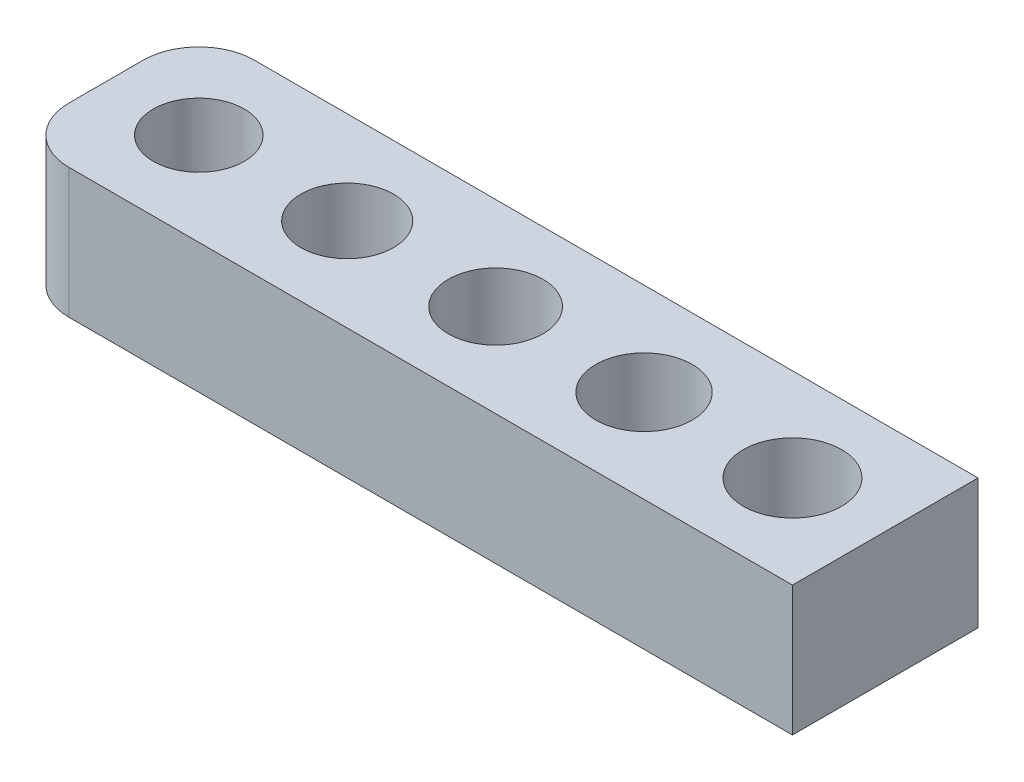
ISO-10303-21;
HEADER;
FILE_DESCRIPTION(('STEP AP214'),'2;1');
FILE_NAME('part.step','',(''),(''),'','','');
FILE_SCHEMA(('AUTOMOTIVE_DESIGN { 1 0 10303 214 1 1 1 1 }'));
ENDSEC;
DATA;
#1=APPLICATION_CONTEXT('core data for automotive mechanical design processes');
#2=APPLICATION_PROTOCOL_DEFINITION('international standard','automotive_design',2000,#1);
#3=PRODUCT_CONTEXT('',#1,'mechanical');
#4=PRODUCT('Part','Part','',(#3));
#5=PRODUCT_RELATED_PRODUCT_CATEGORY('part','',(#4));
#6=PRODUCT_DEFINITION_FORMATION('','',#4);
#7=PRODUCT_DEFINITION_CONTEXT('part definition',#1,'design');
#8=PRODUCT_DEFINITION('design','',#6,#7);
#9=PRODUCT_DEFINITION_SHAPE('','',#8);
#10=(LENGTH_UNIT() NAMED_UNIT(*) SI_UNIT(.MILLI.,.METRE.));
#11=(NAMED_UNIT(*) PLANE_ANGLE_UNIT() SI_UNIT($,.RADIAN.));
#12=(NAMED_UNIT(*) SI_UNIT($,.STERADIAN.) SOLID_ANGLE_UNIT());
#13=UNCERTAINTY_MEASURE_WITH_UNIT(LENGTH_MEASURE(1.E-05),#10,'distance_accuracy_value','');
#14=(GEOMETRIC_REPRESENTATION_CONTEXT(3) GLOBAL_UNCERTAINTY_ASSIGNED_CONTEXT((#13)) GLOBAL_UNIT_ASSIGNED_CONTEXT((#10,
#11,#12)) REPRESENTATION_CONTEXT('',''));
#15=CARTESIAN_POINT('',(0.,0.,0.));
#16=DIRECTION('',(0.,0.,1.));
#17=DIRECTION('',(1.,0.,0.));
#18=AXIS2_PLACEMENT_3D('',#15,#16,#17);
#19=CARTESIAN_POINT('',(0.,7.,0.));
#20=DIRECTION('',(0.,1.,0.));
#21=DIRECTION('',(0.,0.,1.));
#22=AXIS2_PLACEMENT_3D('',#19,#20,#21);
#23=PLANE('',#22);
#24=CARTESIAN_POINT('',(24.,7.,0.));
#25=DIRECTION('',(0.,1.,0.));
#26=DIRECTION('',(0.,0.,1.));
#27=AXIS2_PLACEMENT_3D('',#24,#25,#26);
#28=CIRCLE('',#27,2.6);
#29=CARTESIAN_POINT('',(24.,7.,2.6));
#30=VERTEX_POINT('',#29);
#31=EDGE_CURVE('E195',#30,#30,#28,.T.);
#32=ORIENTED_EDGE('',*,*,#31,.F.);
#33=EDGE_LOOP('',(#32));
#34=FACE_BOUND('',#33,.T.);
#35=CARTESIAN_POINT('',(8.,7.,0.));
#36=DIRECTION('',(0.,1.,0.));
#37=DIRECTION('',(0.,0.,1.));
#38=AXIS2_PLACEMENT_3D('',#35,#36,#37);
#39=CIRCLE('',#38,2.5);
#40=CARTESIAN_POINT('',(8.,7.,2.5));
#41=VERTEX_POINT('',#40);
#42=EDGE_CURVE('E179',#41,#41,#39,.T.);
#43=ORIENTED_EDGE('',*,*,#42,.F.);
#44=EDGE_LOOP('',(#43));
#45=FACE_BOUND('',#44,.T.);
#46=DIRECTION('',(0.,0.,1.));
#47=VECTOR('',#46,1.);
#48=CARTESIAN_POINT('',(-5.,7.,-5.));
#49=LINE('',#48,#47);
#50=CARTESIAN_POINT('',(-5.,7.,-2.));
#51=VERTEX_POINT('',#50);
#52=CARTESIAN_POINT('',(-5.,7.,2.));
#53=VERTEX_POINT('',#52);
#54=EDGE_CURVE('E105',#51,#53,#49,.T.);
#55=ORIENTED_EDGE('',*,*,#54,.T.);
#56=CARTESIAN_POINT('',(-2.,7.,2.));
#57=DIRECTION('',(0.,1.,0.));
#58=DIRECTION('',(0.,0.,1.));
#59=AXIS2_PLACEMENT_3D('',#56,#57,#58);
#60=CIRCLE('',#59,3.);
#61=CARTESIAN_POINT('',(-2.,7.,5.));
#62=VERTEX_POINT('',#61);
#63=EDGE_CURVE('E52',#53,#62,#60,.T.);
#64=ORIENTED_EDGE('',*,*,#63,.T.);
#65=DIRECTION('',(1.,0.,0.));
#66=VECTOR('',#65,1.);
#67=CARTESIAN_POINT('',(-5.,7.,5.));
#68=LINE('',#67,#66);
#69=CARTESIAN_POINT('',(37.,7.,5.));
#70=VERTEX_POINT('',#69);
#71=EDGE_CURVE('E111',#62,#70,#68,.T.);
#72=ORIENTED_EDGE('',*,*,#71,.T.);
#73=DIRECTION('',(0.,0.,-1.));
#74=VECTOR('',#73,1.);
#75=CARTESIAN_POINT('',(37.,7.,-5.));
#76=LINE('',#75,#74);
#77=CARTESIAN_POINT('',(37.,7.,-5.));
#78=VERTEX_POINT('',#77);
#79=EDGE_CURVE('E106',#70,#78,#76,.T.);
#80=ORIENTED_EDGE('',*,*,#79,.T.);
#81=DIRECTION('',(-1.,0.,0.));
#82=VECTOR('',#81,1.);
#83=CARTESIAN_POINT('',(-5.,7.,-5.));
#84=LINE('',#83,#82);
#85=CARTESIAN_POINT('',(-2.,7.,-5.));
#86=VERTEX_POINT('',#85);
#87=EDGE_CURVE('E96',#78,#86,#84,.T.);
#88=ORIENTED_EDGE('',*,*,#87,.T.);
#89=CARTESIAN_POINT('',(-2.,7.,-2.));
#90=DIRECTION('',(0.,1.,0.));
#91=DIRECTION('',(0.,0.,1.));
#92=AXIS2_PLACEMENT_3D('',#89,#90,#91);
#93=CIRCLE('',#92,3.);
#94=EDGE_CURVE('E144',#86,#51,#93,.T.);
#95=ORIENTED_EDGE('',*,*,#94,.T.);
#96=EDGE_LOOP('',(#55,#64,#72,#80,#88,#95));
#97=FACE_BOUND('',#96,.T.);
#98=CARTESIAN_POINT('',(0.,7.,0.));
#99=DIRECTION('',(0.,1.,0.));
#100=DIRECTION('',(0.,0.,1.));
#101=AXIS2_PLACEMENT_3D('',#98,#99,#100);
#102=CIRCLE('',#101,2.45);
#103=CARTESIAN_POINT('',(0.,7.,2.45));
#104=VERTEX_POINT('',#103);
#105=EDGE_CURVE('E171',#104,#104,#102,.T.);
#106=ORIENTED_EDGE('',*,*,#105,.F.);
#107=EDGE_LOOP('',(#106));
#108=FACE_BOUND('',#107,.T.);
#109=CARTESIAN_POINT('',(16.,7.,0.));
#110=DIRECTION('',(0.,1.,0.));
#111=DIRECTION('',(0.,0.,1.));
#112=AXIS2_PLACEMENT_3D('',#109,#110,#111);
#113=CIRCLE('',#112,2.55);
#114=CARTESIAN_POINT('',(16.,7.,2.55));
#115=VERTEX_POINT('',#114);
#116=EDGE_CURVE('E187',#115,#115,#113,.T.);
#117=ORIENTED_EDGE('',*,*,#116,.F.);
#118=EDGE_LOOP('',(#117));
#119=FACE_BOUND('',#118,.T.);
#120=CARTESIAN_POINT('',(32.,7.,0.));
#121=DIRECTION('',(0.,1.,0.));
#122=DIRECTION('',(0.,0.,1.));
#123=AXIS2_PLACEMENT_3D('',#120,#121,#122);
#124=CIRCLE('',#123,2.65);
#125=CARTESIAN_POINT('',(32.,7.,2.65));
#126=VERTEX_POINT('',#125);
#127=EDGE_CURVE('E203',#126,#126,#124,.T.);
#128=ORIENTED_EDGE('',*,*,#127,.F.);
#129=EDGE_LOOP('',(#128));
#130=FACE_BOUND('',#129,.T.);
#131=ADVANCED_FACE('F43',(#34,#45,#97,#108,#119,#130),#23,.T.);
#132=CARTESIAN_POINT('',(0.,0.,0.));
#133=DIRECTION('',(0.,1.,0.));
#134=DIRECTION('',(0.,0.,1.));
#135=AXIS2_PLACEMENT_3D('',#132,#133,#134);
#136=PLANE('',#135);
#137=DIRECTION('',(1.,0.,0.));
#138=VECTOR('',#137,1.);
#139=CARTESIAN_POINT('',(-5.,0.,5.));
#140=LINE('',#139,#138);
#141=CARTESIAN_POINT('',(-2.,0.,5.));
#142=VERTEX_POINT('',#141);
#143=CARTESIAN_POINT('',(37.,0.,5.));
#144=VERTEX_POINT('',#143);
#145=EDGE_CURVE('E116',#142,#144,#140,.T.);
#146=ORIENTED_EDGE('',*,*,#145,.F.);
#147=CARTESIAN_POINT('',(-2.,0.,2.));
#148=DIRECTION('',(0.,1.,0.));
#149=DIRECTION('',(0.,0.,1.));
#150=AXIS2_PLACEMENT_3D('',#147,#148,#149);
#151=CIRCLE('',#150,3.);
#152=CARTESIAN_POINT('',(-5.,0.,2.));
#153=VERTEX_POINT('',#152);
#154=EDGE_CURVE('E135',#142,#153,#151,.F.);
#155=ORIENTED_EDGE('',*,*,#154,.T.);
#156=DIRECTION('',(0.,0.,1.));
#157=VECTOR('',#156,1.);
#158=CARTESIAN_POINT('',(-5.,0.,-5.));
#159=LINE('',#158,#157);
#160=CARTESIAN_POINT('',(-5.,0.,-2.));
#161=VERTEX_POINT('',#160);
#162=EDGE_CURVE('E160',#161,#153,#159,.T.);
#163=ORIENTED_EDGE('',*,*,#162,.F.);
#164=CARTESIAN_POINT('',(-2.,0.,-2.));
#165=DIRECTION('',(0.,1.,0.));
#166=DIRECTION('',(0.,0.,1.));
#167=AXIS2_PLACEMENT_3D('',#164,#165,#166);
#168=CIRCLE('',#167,3.);
#169=CARTESIAN_POINT('',(-2.,0.,-5.));
#170=VERTEX_POINT('',#169);
#171=EDGE_CURVE('E128',#161,#170,#168,.F.);
#172=ORIENTED_EDGE('',*,*,#171,.T.);
#173=DIRECTION('',(-1.,0.,0.));
#174=VECTOR('',#173,1.);
#175=CARTESIAN_POINT('',(-5.,0.,-5.));
#176=LINE('',#175,#174);
#177=CARTESIAN_POINT('',(37.,0.,-5.));
#178=VERTEX_POINT('',#177);
#179=EDGE_CURVE('E164',#178,#170,#176,.T.);
#180=ORIENTED_EDGE('',*,*,#179,.F.);
#181=DIRECTION('',(0.,0.,-1.));
#182=VECTOR('',#181,1.);
#183=CARTESIAN_POINT('',(37.,0.,-5.));
#184=LINE('',#183,#182);
#185=EDGE_CURVE('E120',#144,#178,#184,.T.);
#186=ORIENTED_EDGE('',*,*,#185,.F.);
#187=EDGE_LOOP('',(#146,#155,#163,#172,#180,#186));
#188=FACE_BOUND('',#187,.T.);
#189=CARTESIAN_POINT('',(0.,0.,0.));
#190=DIRECTION('',(0.,1.,0.));
#191=DIRECTION('',(0.,0.,1.));
#192=AXIS2_PLACEMENT_3D('',#189,#190,#191);
#193=CIRCLE('',#192,2.45);
#194=CARTESIAN_POINT('',(0.,0.,2.45));
#195=VERTEX_POINT('',#194);
#196=EDGE_CURVE('E175',#195,#195,#193,.T.);
#197=ORIENTED_EDGE('',*,*,#196,.T.);
#198=EDGE_LOOP('',(#197));
#199=FACE_BOUND('',#198,.T.);
#200=CARTESIAN_POINT('',(8.,0.,0.));
#201=DIRECTION('',(0.,1.,0.));
#202=DIRECTION('',(0.,0.,1.));
#203=AXIS2_PLACEMENT_3D('',#200,#201,#202);
#204=CIRCLE('',#203,2.5);
#205=CARTESIAN_POINT('',(8.,0.,2.5));
#206=VERTEX_POINT('',#205);
#207=EDGE_CURVE('E183',#206,#206,#204,.T.);
#208=ORIENTED_EDGE('',*,*,#207,.T.);
#209=EDGE_LOOP('',(#208));
#210=FACE_BOUND('',#209,.T.);
#211=CARTESIAN_POINT('',(16.,0.,0.));
#212=DIRECTION('',(0.,1.,0.));
#213=DIRECTION('',(0.,0.,1.));
#214=AXIS2_PLACEMENT_3D('',#211,#212,#213);
#215=CIRCLE('',#214,2.55);
#216=CARTESIAN_POINT('',(16.,0.,2.55));
#217=VERTEX_POINT('',#216);
#218=EDGE_CURVE('E191',#217,#217,#215,.T.);
#219=ORIENTED_EDGE('',*,*,#218,.T.);
#220=EDGE_LOOP('',(#219));
#221=FACE_BOUND('',#220,.T.);
#222=CARTESIAN_POINT('',(24.,0.,0.));
#223=DIRECTION('',(0.,1.,0.));
#224=DIRECTION('',(0.,0.,1.));
#225=AXIS2_PLACEMENT_3D('',#222,#223,#224);
#226=CIRCLE('',#225,2.6);
#227=CARTESIAN_POINT('',(24.,0.,2.6));
#228=VERTEX_POINT('',#227);
#229=EDGE_CURVE('E199',#228,#228,#226,.T.);
#230=ORIENTED_EDGE('',*,*,#229,.T.);
#231=EDGE_LOOP('',(#230));
#232=FACE_BOUND('',#231,.T.);
#233=CARTESIAN_POINT('',(32.,0.,0.));
#234=DIRECTION('',(0.,1.,0.));
#235=DIRECTION('',(0.,0.,1.));
#236=AXIS2_PLACEMENT_3D('',#233,#234,#235);
#237=CIRCLE('',#236,2.65);
#238=CARTESIAN_POINT('',(32.,0.,2.65));
#239=VERTEX_POINT('',#238);
#240=EDGE_CURVE('E207',#239,#239,#237,.T.);
#241=ORIENTED_EDGE('',*,*,#240,.T.);
#242=EDGE_LOOP('',(#241));
#243=FACE_BOUND('',#242,.T.);
#244=ADVANCED_FACE('F158',(#188,#199,#210,#221,#232,#243),#136,.F.);
#245=CARTESIAN_POINT('',(37.,7.,-5.));
#246=DIRECTION('',(-1.,0.,0.));
#247=DIRECTION('',(0.,0.,1.));
#248=AXIS2_PLACEMENT_3D('',#245,#246,#247);
#249=PLANE('',#248);
#250=ORIENTED_EDGE('',*,*,#185,.T.);
#251=DIRECTION('',(0.,-1.,0.));
#252=VECTOR('',#251,1.);
#253=CARTESIAN_POINT('',(37.,7.,-5.));
#254=LINE('',#253,#252);
#255=EDGE_CURVE('E100',#78,#178,#254,.T.);
#256=ORIENTED_EDGE('',*,*,#255,.F.);
#257=ORIENTED_EDGE('',*,*,#79,.F.);
#258=DIRECTION('',(0.,-1.,0.));
#259=VECTOR('',#258,1.);
#260=CARTESIAN_POINT('',(37.,7.,5.));
#261=LINE('',#260,#259);
#262=EDGE_CURVE('E123',#70,#144,#261,.T.);
#263=ORIENTED_EDGE('',*,*,#262,.T.);
#264=EDGE_LOOP('',(#250,#256,#257,#263));
#265=FACE_BOUND('',#264,.T.);
#266=ADVANCED_FACE('F118',(#265),#249,.F.);
#267=CARTESIAN_POINT('',(-5.,7.,-5.));
#268=DIRECTION('',(0.,0.,1.));
#269=DIRECTION('',(1.,0.,0.));
#270=AXIS2_PLACEMENT_3D('',#267,#268,#269);
#271=PLANE('',#270);
#272=ORIENTED_EDGE('',*,*,#179,.T.);
#273=DIRECTION('',(0.,-1.,0.));
#274=VECTOR('',#273,1.);
#275=CARTESIAN_POINT('',(-2.,7.,-5.));
#276=LINE('',#275,#274);
#277=EDGE_CURVE('E11',#170,#86,#276,.F.);
#278=ORIENTED_EDGE('',*,*,#277,.T.);
#279=ORIENTED_EDGE('',*,*,#87,.F.);
#280=ORIENTED_EDGE('',*,*,#255,.T.);
#281=EDGE_LOOP('',(#272,#278,#279,#280));
#282=FACE_BOUND('',#281,.T.);
#283=ADVANCED_FACE('F98',(#282),#271,.F.);
#284=CARTESIAN_POINT('',(-5.,7.,-5.));
#285=DIRECTION('',(1.,0.,0.));
#286=DIRECTION('',(0.,0.,-1.));
#287=AXIS2_PLACEMENT_3D('',#284,#285,#286);
#288=PLANE('',#287);
#289=ORIENTED_EDGE('',*,*,#162,.T.);
#290=DIRECTION('',(0.,-1.,0.));
#291=VECTOR('',#290,1.);
#292=CARTESIAN_POINT('',(-5.,7.,2.));
#293=LINE('',#292,#291);
#294=EDGE_CURVE('E65',#153,#53,#293,.F.);
#295=ORIENTED_EDGE('',*,*,#294,.T.);
#296=ORIENTED_EDGE('',*,*,#54,.F.);
#297=DIRECTION('',(0.,-1.,0.));
#298=VECTOR('',#297,1.);
#299=CARTESIAN_POINT('',(-5.,7.,-2.));
#300=LINE('',#299,#298);
#301=EDGE_CURVE('E138',#51,#161,#300,.T.);
#302=ORIENTED_EDGE('',*,*,#301,.T.);
#303=EDGE_LOOP('',(#289,#295,#296,#302));
#304=FACE_BOUND('',#303,.T.);
#305=ADVANCED_FACE('F161',(#304),#288,.F.);
#306=CARTESIAN_POINT('',(-5.,7.,5.));
#307=DIRECTION('',(0.,0.,-1.));
#308=DIRECTION('',(-1.,0.,0.));
#309=AXIS2_PLACEMENT_3D('',#306,#307,#308);
#310=PLANE('',#309);
#311=ORIENTED_EDGE('',*,*,#71,.F.);
#312=DIRECTION('',(0.,-1.,0.));
#313=VECTOR('',#312,1.);
#314=CARTESIAN_POINT('',(-2.,7.,5.));
#315=LINE('',#314,#313);
#316=EDGE_CURVE('E122',#62,#142,#315,.T.);
#317=ORIENTED_EDGE('',*,*,#316,.T.);
#318=ORIENTED_EDGE('',*,*,#145,.T.);
#319=ORIENTED_EDGE('',*,*,#262,.F.);
#320=EDGE_LOOP('',(#311,#317,#318,#319));
#321=FACE_BOUND('',#320,.T.);
#322=ADVANCED_FACE('F151',(#321),#310,.F.);
#323=CARTESIAN_POINT('',(0.,7.,0.));
#324=DIRECTION('',(0.,-1.,0.));
#325=DIRECTION('',(0.,0.,-1.));
#326=AXIS2_PLACEMENT_3D('',#323,#324,#325);
#327=CYLINDRICAL_SURFACE('',#326,2.45);
#328=ORIENTED_EDGE('',*,*,#105,.T.);
#329=EDGE_LOOP('',(#328));
#330=FACE_BOUND('',#329,.T.);
#331=ORIENTED_EDGE('',*,*,#196,.F.);
#332=EDGE_LOOP('',(#331));
#333=FACE_BOUND('',#332,.T.);
#334=ADVANCED_FACE('F228',(#330,#333),#327,.F.);
#335=CARTESIAN_POINT('',(8.,7.,0.));
#336=DIRECTION('',(0.,-1.,0.));
#337=DIRECTION('',(0.,0.,-1.));
#338=AXIS2_PLACEMENT_3D('',#335,#336,#337);
#339=CYLINDRICAL_SURFACE('',#338,2.5);
#340=ORIENTED_EDGE('',*,*,#42,.T.);
#341=EDGE_LOOP('',(#340));
#342=FACE_BOUND('',#341,.T.);
#343=ORIENTED_EDGE('',*,*,#207,.F.);
#344=EDGE_LOOP('',(#343));
#345=FACE_BOUND('',#344,.T.);
#346=ADVANCED_FACE('F254',(#342,#345),#339,.F.);
#347=CARTESIAN_POINT('',(16.,7.,0.));
#348=DIRECTION('',(0.,-1.,0.));
#349=DIRECTION('',(0.,0.,-1.));
#350=AXIS2_PLACEMENT_3D('',#347,#348,#349);
#351=CYLINDRICAL_SURFACE('',#350,2.55);
#352=ORIENTED_EDGE('',*,*,#116,.T.);
#353=EDGE_LOOP('',(#352));
#354=FACE_BOUND('',#353,.T.);
#355=ORIENTED_EDGE('',*,*,#218,.F.);
#356=EDGE_LOOP('',(#355));
#357=FACE_BOUND('',#356,.T.);
#358=ADVANCED_FACE('F249',(#354,#357),#351,.F.);
#359=CARTESIAN_POINT('',(24.,7.,0.));
#360=DIRECTION('',(0.,-1.,0.));
#361=DIRECTION('',(0.,0.,-1.));
#362=AXIS2_PLACEMENT_3D('',#359,#360,#361);
#363=CYLINDRICAL_SURFACE('',#362,2.6);
#364=ORIENTED_EDGE('',*,*,#31,.T.);
#365=EDGE_LOOP('',(#364));
#366=FACE_BOUND('',#365,.T.);
#367=ORIENTED_EDGE('',*,*,#229,.F.);
#368=EDGE_LOOP('',(#367));
#369=FACE_BOUND('',#368,.T.);
#370=ADVANCED_FACE('F244',(#366,#369),#363,.F.);
#371=CARTESIAN_POINT('',(32.,7.,0.));
#372=DIRECTION('',(0.,-1.,0.));
#373=DIRECTION('',(0.,0.,-1.));
#374=AXIS2_PLACEMENT_3D('',#371,#372,#373);
#375=CYLINDRICAL_SURFACE('',#374,2.65);
#376=ORIENTED_EDGE('',*,*,#127,.T.);
#377=EDGE_LOOP('',(#376));
#378=FACE_BOUND('',#377,.T.);
#379=ORIENTED_EDGE('',*,*,#240,.F.);
#380=EDGE_LOOP('',(#379));
#381=FACE_BOUND('',#380,.T.);
#382=ADVANCED_FACE('F215',(#378,#381),#375,.F.);
#383=CARTESIAN_POINT('',(-2.,7.,2.));
#384=DIRECTION('',(0.,-1.,0.));
#385=DIRECTION('',(0.,0.,-1.));
#386=AXIS2_PLACEMENT_3D('',#383,#384,#385);
#387=CYLINDRICAL_SURFACE('',#386,3.);
#388=ORIENTED_EDGE('',*,*,#63,.F.);
#389=ORIENTED_EDGE('',*,*,#294,.F.);
#390=ORIENTED_EDGE('',*,*,#154,.F.);
#391=ORIENTED_EDGE('',*,*,#316,.F.);
#392=EDGE_LOOP('',(#388,#389,#390,#391));
#393=FACE_BOUND('',#392,.T.);
#394=ADVANCED_FACE('F155',(#393),#387,.T.);
#395=CARTESIAN_POINT('',(-2.,7.,-2.));
#396=DIRECTION('',(0.,-1.,0.));
#397=DIRECTION('',(0.,0.,-1.));
#398=AXIS2_PLACEMENT_3D('',#395,#396,#397);
#399=CYLINDRICAL_SURFACE('',#398,3.);
#400=ORIENTED_EDGE('',*,*,#94,.F.);
#401=ORIENTED_EDGE('',*,*,#277,.F.);
#402=ORIENTED_EDGE('',*,*,#171,.F.);
#403=ORIENTED_EDGE('',*,*,#301,.F.);
#404=EDGE_LOOP('',(#400,#401,#402,#403));
#405=FACE_BOUND('',#404,.T.);
#406=ADVANCED_FACE('F45',(#405),#399,.T.);
#407=CLOSED_SHELL('',(#131,#244,#266,#283,#305,#322,#334,#346,#358,#370,#382,#394,#406));
#408=MANIFOLD_SOLID_BREP('B2',#407);
#409=ADVANCED_BREP_SHAPE_REPRESENTATION('',(#18,#408),#14);
#410=SHAPE_DEFINITION_REPRESENTATION(#9,#409);
ENDSEC;
END-ISO-10303-21;
